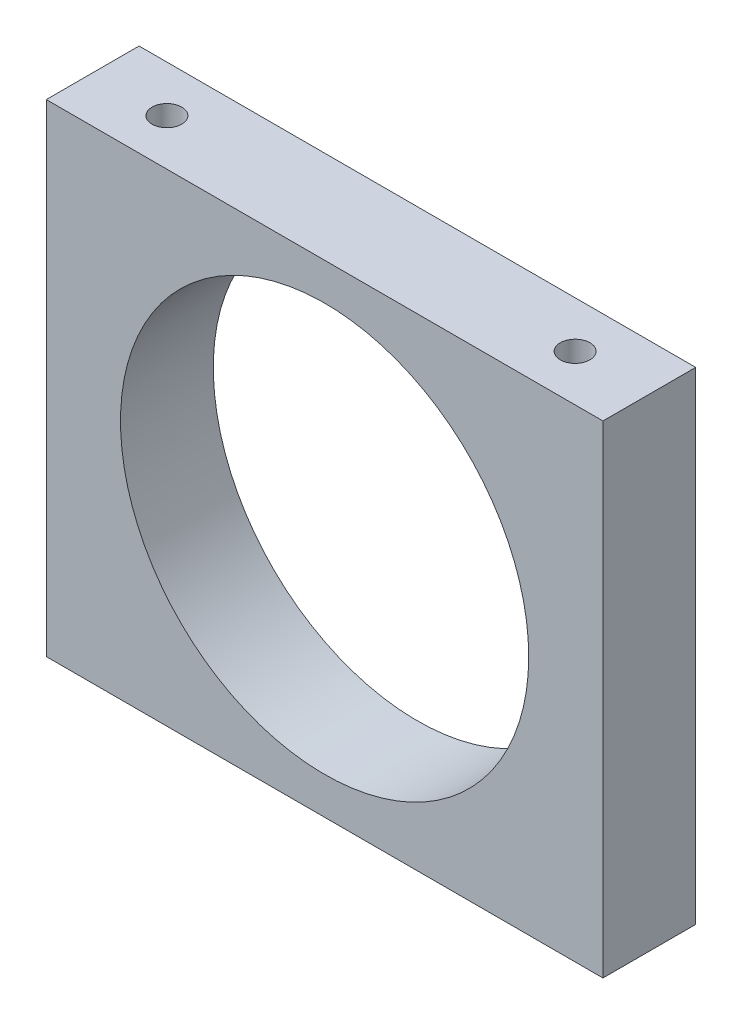
ISO-10303-21;
HEADER;
FILE_DESCRIPTION(('STEP AP214'),'2;1');
FILE_NAME('part.step','',(''),(''),'','','');
FILE_SCHEMA(('AUTOMOTIVE_DESIGN { 1 0 10303 214 1 1 1 1 }'));
ENDSEC;
DATA;
#1=APPLICATION_CONTEXT('core data for automotive mechanical design processes');
#2=APPLICATION_PROTOCOL_DEFINITION('international standard','automotive_design',2000,#1);
#3=PRODUCT_CONTEXT('',#1,'mechanical');
#4=PRODUCT('Part','Part','',(#3));
#5=PRODUCT_RELATED_PRODUCT_CATEGORY('part','',(#4));
#6=PRODUCT_DEFINITION_FORMATION('','',#4);
#7=PRODUCT_DEFINITION_CONTEXT('part definition',#1,'design');
#8=PRODUCT_DEFINITION('design','',#6,#7);
#9=PRODUCT_DEFINITION_SHAPE('','',#8);
#10=(LENGTH_UNIT() NAMED_UNIT(*) SI_UNIT(.MILLI.,.METRE.));
#11=(NAMED_UNIT(*) PLANE_ANGLE_UNIT() SI_UNIT($,.RADIAN.));
#12=(NAMED_UNIT(*) SI_UNIT($,.STERADIAN.) SOLID_ANGLE_UNIT());
#13=UNCERTAINTY_MEASURE_WITH_UNIT(LENGTH_MEASURE(1.E-05),#10,'distance_accuracy_value','');
#14=(GEOMETRIC_REPRESENTATION_CONTEXT(3) GLOBAL_UNCERTAINTY_ASSIGNED_CONTEXT((#13)) GLOBAL_UNIT_ASSIGNED_CONTEXT((#10,
#11,#12)) REPRESENTATION_CONTEXT('',''));
#15=CARTESIAN_POINT('',(0.,0.,0.));
#16=DIRECTION('',(0.,0.,1.));
#17=DIRECTION('',(1.,0.,0.));
#18=AXIS2_PLACEMENT_3D('',#15,#16,#17);
#19=CARTESIAN_POINT('',(0.,0.,5.));
#20=DIRECTION('',(0.,0.,-1.));
#21=DIRECTION('',(-1.,0.,0.));
#22=AXIS2_PLACEMENT_3D('',#19,#20,#21);
#23=PLANE('',#22);
#24=DIRECTION('',(0.,-1.,0.));
#25=VECTOR('',#24,1.);
#26=CARTESIAN_POINT('',(0.,0.,5.));
#27=LINE('',#26,#25);
#28=CARTESIAN_POINT('',(0.,26.,5.));
#29=VERTEX_POINT('',#28);
#30=CARTESIAN_POINT('',(0.,0.,5.));
#31=VERTEX_POINT('',#30);
#32=EDGE_CURVE('E134',#29,#31,#27,.T.);
#33=ORIENTED_EDGE('',*,*,#32,.T.);
#34=DIRECTION('',(1.,0.,0.));
#35=VECTOR('',#34,1.);
#36=CARTESIAN_POINT('',(0.,0.,5.));
#37=LINE('',#36,#35);
#38=CARTESIAN_POINT('',(30.,0.,5.));
#39=VERTEX_POINT('',#38);
#40=EDGE_CURVE('E81',#31,#39,#37,.T.);
#41=ORIENTED_EDGE('',*,*,#40,.T.);
#42=DIRECTION('',(0.,1.,0.));
#43=VECTOR('',#42,1.);
#44=CARTESIAN_POINT('',(30.,0.,5.));
#45=LINE('',#44,#43);
#46=CARTESIAN_POINT('',(30.,26.,5.));
#47=VERTEX_POINT('',#46);
#48=EDGE_CURVE('E137',#39,#47,#45,.T.);
#49=ORIENTED_EDGE('',*,*,#48,.T.);
#50=DIRECTION('',(-1.,0.,0.));
#51=VECTOR('',#50,1.);
#52=CARTESIAN_POINT('',(0.,26.,5.));
#53=LINE('',#52,#51);
#54=EDGE_CURVE('E50',#47,#29,#53,.T.);
#55=ORIENTED_EDGE('',*,*,#54,.T.);
#56=EDGE_LOOP('',(#33,#41,#49,#55));
#57=FACE_BOUND('',#56,.T.);
#58=CARTESIAN_POINT('',(15.,13.,5.));
#59=DIRECTION('',(0.,0.,1.));
#60=DIRECTION('',(1.,0.,0.));
#61=AXIS2_PLACEMENT_3D('',#58,#59,#60);
#62=CIRCLE('',#61,11.);
#63=CARTESIAN_POINT('',(26.,13.,5.));
#64=VERTEX_POINT('',#63);
#65=EDGE_CURVE('E128',#64,#64,#62,.T.);
#66=ORIENTED_EDGE('',*,*,#65,.F.);
#67=EDGE_LOOP('',(#66));
#68=FACE_BOUND('',#67,.T.);
#69=ADVANCED_FACE('F33',(#57,#68),#23,.F.);
#70=CARTESIAN_POINT('',(0.,0.,0.));
#71=DIRECTION('',(0.,0.,-1.));
#72=DIRECTION('',(-1.,0.,0.));
#73=AXIS2_PLACEMENT_3D('',#70,#71,#72);
#74=PLANE('',#73);
#75=DIRECTION('',(0.,-1.,0.));
#76=VECTOR('',#75,1.);
#77=CARTESIAN_POINT('',(0.,0.,0.));
#78=LINE('',#77,#76);
#79=CARTESIAN_POINT('',(0.,26.,0.));
#80=VERTEX_POINT('',#79);
#81=CARTESIAN_POINT('',(0.,0.,0.));
#82=VERTEX_POINT('',#81);
#83=EDGE_CURVE('E131',#80,#82,#78,.T.);
#84=ORIENTED_EDGE('',*,*,#83,.F.);
#85=DIRECTION('',(-1.,0.,0.));
#86=VECTOR('',#85,1.);
#87=CARTESIAN_POINT('',(0.,26.,0.));
#88=LINE('',#87,#86);
#89=CARTESIAN_POINT('',(30.,26.,0.));
#90=VERTEX_POINT('',#89);
#91=EDGE_CURVE('E74',#90,#80,#88,.T.);
#92=ORIENTED_EDGE('',*,*,#91,.F.);
#93=DIRECTION('',(0.,1.,0.));
#94=VECTOR('',#93,1.);
#95=CARTESIAN_POINT('',(30.,0.,0.));
#96=LINE('',#95,#94);
#97=CARTESIAN_POINT('',(30.,0.,0.));
#98=VERTEX_POINT('',#97);
#99=EDGE_CURVE('E68',#98,#90,#96,.T.);
#100=ORIENTED_EDGE('',*,*,#99,.F.);
#101=DIRECTION('',(1.,0.,0.));
#102=VECTOR('',#101,1.);
#103=CARTESIAN_POINT('',(0.,0.,0.));
#104=LINE('',#103,#102);
#105=EDGE_CURVE('E143',#82,#98,#104,.T.);
#106=ORIENTED_EDGE('',*,*,#105,.F.);
#107=EDGE_LOOP('',(#84,#92,#100,#106));
#108=FACE_BOUND('',#107,.T.);
#109=CARTESIAN_POINT('',(15.,13.,0.));
#110=DIRECTION('',(0.,0.,1.));
#111=DIRECTION('',(1.,0.,0.));
#112=AXIS2_PLACEMENT_3D('',#109,#110,#111);
#113=CIRCLE('',#112,11.);
#114=CARTESIAN_POINT('',(26.,13.,0.));
#115=VERTEX_POINT('',#114);
#116=EDGE_CURVE('E127',#115,#115,#113,.T.);
#117=ORIENTED_EDGE('',*,*,#116,.T.);
#118=EDGE_LOOP('',(#117));
#119=FACE_BOUND('',#118,.T.);
#120=ADVANCED_FACE('F153',(#108,#119),#74,.T.);
#121=CARTESIAN_POINT('',(0.,0.,5.));
#122=DIRECTION('',(1.,0.,0.));
#123=DIRECTION('',(0.,0.,-1.));
#124=AXIS2_PLACEMENT_3D('',#121,#122,#123);
#125=PLANE('',#124);
#126=ORIENTED_EDGE('',*,*,#83,.T.);
#127=DIRECTION('',(0.,0.,-1.));
#128=VECTOR('',#127,1.);
#129=CARTESIAN_POINT('',(0.,0.,5.));
#130=LINE('',#129,#128);
#131=EDGE_CURVE('E11',#31,#82,#130,.T.);
#132=ORIENTED_EDGE('',*,*,#131,.F.);
#133=ORIENTED_EDGE('',*,*,#32,.F.);
#134=DIRECTION('',(0.,0.,-1.));
#135=VECTOR('',#134,1.);
#136=CARTESIAN_POINT('',(0.,26.,5.));
#137=LINE('',#136,#135);
#138=EDGE_CURVE('E140',#29,#80,#137,.T.);
#139=ORIENTED_EDGE('',*,*,#138,.T.);
#140=EDGE_LOOP('',(#126,#132,#133,#139));
#141=FACE_BOUND('',#140,.T.);
#142=ADVANCED_FACE('F35',(#141),#125,.F.);
#143=CARTESIAN_POINT('',(0.,0.,5.));
#144=DIRECTION('',(0.,1.,0.));
#145=DIRECTION('',(0.,0.,1.));
#146=AXIS2_PLACEMENT_3D('',#143,#144,#145);
#147=PLANE('',#146);
#148=CARTESIAN_POINT('',(4.,0.,2.5));
#149=DIRECTION('',(0.,-1.,0.));
#150=DIRECTION('',(0.,0.,-1.));
#151=AXIS2_PLACEMENT_3D('',#148,#149,#150);
#152=CIRCLE('',#151,0.79999999999999);
#153=CARTESIAN_POINT('',(4.,0.,1.70000000000001));
#154=VERTEX_POINT('',#153);
#155=EDGE_CURVE('E105',#154,#154,#152,.T.);
#156=ORIENTED_EDGE('',*,*,#155,.F.);
#157=EDGE_LOOP('',(#156));
#158=FACE_BOUND('',#157,.T.);
#159=CARTESIAN_POINT('',(26.,0.,2.5));
#160=DIRECTION('',(0.,-1.,0.));
#161=DIRECTION('',(0.,0.,-1.));
#162=AXIS2_PLACEMENT_3D('',#159,#160,#161);
#163=CIRCLE('',#162,0.799999999999992);
#164=CARTESIAN_POINT('',(26.,0.,1.70000000000001));
#165=VERTEX_POINT('',#164);
#166=EDGE_CURVE('E104',#165,#165,#163,.T.);
#167=ORIENTED_EDGE('',*,*,#166,.F.);
#168=EDGE_LOOP('',(#167));
#169=FACE_BOUND('',#168,.T.);
#170=ORIENTED_EDGE('',*,*,#105,.T.);
#171=DIRECTION('',(0.,0.,-1.));
#172=VECTOR('',#171,1.);
#173=CARTESIAN_POINT('',(30.,0.,5.));
#174=LINE('',#173,#172);
#175=EDGE_CURVE('E42',#39,#98,#174,.T.);
#176=ORIENTED_EDGE('',*,*,#175,.F.);
#177=ORIENTED_EDGE('',*,*,#40,.F.);
#178=ORIENTED_EDGE('',*,*,#131,.T.);
#179=EDGE_LOOP('',(#170,#176,#177,#178));
#180=FACE_BOUND('',#179,.T.);
#181=ADVANCED_FACE('F170',(#158,#169,#180),#147,.F.);
#182=CARTESIAN_POINT('',(30.,0.,5.));
#183=DIRECTION('',(-1.,0.,0.));
#184=DIRECTION('',(0.,0.,1.));
#185=AXIS2_PLACEMENT_3D('',#182,#183,#184);
#186=PLANE('',#185);
#187=ORIENTED_EDGE('',*,*,#99,.T.);
#188=DIRECTION('',(0.,0.,-1.));
#189=VECTOR('',#188,1.);
#190=CARTESIAN_POINT('',(30.,26.,5.));
#191=LINE('',#190,#189);
#192=EDGE_CURVE('E148',#47,#90,#191,.T.);
#193=ORIENTED_EDGE('',*,*,#192,.F.);
#194=ORIENTED_EDGE('',*,*,#48,.F.);
#195=ORIENTED_EDGE('',*,*,#175,.T.);
#196=EDGE_LOOP('',(#187,#193,#194,#195));
#197=FACE_BOUND('',#196,.T.);
#198=ADVANCED_FACE('F150',(#197),#186,.F.);
#199=CARTESIAN_POINT('',(0.,26.,5.));
#200=DIRECTION('',(0.,-1.,0.));
#201=DIRECTION('',(0.,0.,-1.));
#202=AXIS2_PLACEMENT_3D('',#199,#200,#201);
#203=PLANE('',#202);
#204=CARTESIAN_POINT('',(4.,26.,2.5));
#205=DIRECTION('',(0.,1.,0.));
#206=DIRECTION('',(0.,0.,1.));
#207=AXIS2_PLACEMENT_3D('',#204,#205,#206);
#208=CIRCLE('',#207,0.79999999999999);
#209=CARTESIAN_POINT('',(4.,26.,3.29999999999999));
#210=VERTEX_POINT('',#209);
#211=EDGE_CURVE('E115',#210,#210,#208,.T.);
#212=ORIENTED_EDGE('',*,*,#211,.F.);
#213=EDGE_LOOP('',(#212));
#214=FACE_BOUND('',#213,.T.);
#215=CARTESIAN_POINT('',(26.,26.,2.5));
#216=DIRECTION('',(0.,1.,0.));
#217=DIRECTION('',(0.,0.,1.));
#218=AXIS2_PLACEMENT_3D('',#215,#216,#217);
#219=CIRCLE('',#218,0.799999999999992);
#220=CARTESIAN_POINT('',(26.,26.,3.29999999999999));
#221=VERTEX_POINT('',#220);
#222=EDGE_CURVE('E121',#221,#221,#219,.T.);
#223=ORIENTED_EDGE('',*,*,#222,.F.);
#224=EDGE_LOOP('',(#223));
#225=FACE_BOUND('',#224,.T.);
#226=ORIENTED_EDGE('',*,*,#91,.T.);
#227=ORIENTED_EDGE('',*,*,#138,.F.);
#228=ORIENTED_EDGE('',*,*,#54,.F.);
#229=ORIENTED_EDGE('',*,*,#192,.T.);
#230=EDGE_LOOP('',(#226,#227,#228,#229));
#231=FACE_BOUND('',#230,.T.);
#232=ADVANCED_FACE('F158',(#214,#225,#231),#203,.F.);
#233=CARTESIAN_POINT('',(15.,13.,5.));
#234=DIRECTION('',(0.,0.,-1.));
#235=DIRECTION('',(-1.,0.,0.));
#236=AXIS2_PLACEMENT_3D('',#233,#234,#235);
#237=CYLINDRICAL_SURFACE('',#236,11.);
#238=ORIENTED_EDGE('',*,*,#65,.T.);
#239=EDGE_LOOP('',(#238));
#240=FACE_BOUND('',#239,.T.);
#241=ORIENTED_EDGE('',*,*,#116,.F.);
#242=EDGE_LOOP('',(#241));
#243=FACE_BOUND('',#242,.T.);
#244=ADVANCED_FACE('F160',(#240,#243),#237,.F.);
#245=CARTESIAN_POINT('',(26.,21.,2.5));
#246=DIRECTION('',(0.,1.,0.));
#247=DIRECTION('',(0.,0.,1.));
#248=AXIS2_PLACEMENT_3D('',#245,#246,#247);
#249=CONICAL_SURFACE('',#248,0.799999999999988,1.02974425867665);
#250=CARTESIAN_POINT('',(26.,20.519311504778,2.5));
#251=VERTEX_POINT('',#250);
#252=VERTEX_LOOP('',#251);
#253=FACE_BOUND('',#252,.T.);
#254=CARTESIAN_POINT('',(26.,21.,2.5));
#255=DIRECTION('',(0.,1.,0.));
#256=DIRECTION('',(0.,0.,1.));
#257=AXIS2_PLACEMENT_3D('',#254,#255,#256);
#258=CIRCLE('',#257,0.799999999999988);
#259=CARTESIAN_POINT('',(26.,21.,3.29999999999999));
#260=VERTEX_POINT('',#259);
#261=EDGE_CURVE('E124',#260,#260,#258,.T.);
#262=ORIENTED_EDGE('',*,*,#261,.T.);
#263=EDGE_LOOP('',(#262));
#264=FACE_BOUND('',#263,.T.);
#265=ADVANCED_FACE('F167',(#253,#264),#249,.F.);
#266=CARTESIAN_POINT('',(26.,26.,2.5));
#267=DIRECTION('',(0.,1.,0.));
#268=DIRECTION('',(0.,0.,1.));
#269=AXIS2_PLACEMENT_3D('',#266,#267,#268);
#270=CYLINDRICAL_SURFACE('',#269,0.79999999999999);
#271=ORIENTED_EDGE('',*,*,#261,.F.);
#272=EDGE_LOOP('',(#271));
#273=FACE_BOUND('',#272,.T.);
#274=ORIENTED_EDGE('',*,*,#222,.T.);
#275=EDGE_LOOP('',(#274));
#276=FACE_BOUND('',#275,.T.);
#277=ADVANCED_FACE('F184',(#273,#276),#270,.F.);
#278=CARTESIAN_POINT('',(4.,21.,2.5));
#279=DIRECTION('',(0.,1.,0.));
#280=DIRECTION('',(0.,0.,1.));
#281=AXIS2_PLACEMENT_3D('',#278,#279,#280);
#282=CONICAL_SURFACE('',#281,0.799999999999988,1.02974425867665);
#283=CARTESIAN_POINT('',(4.,20.519311504778,2.5));
#284=VERTEX_POINT('',#283);
#285=VERTEX_LOOP('',#284);
#286=FACE_BOUND('',#285,.T.);
#287=CARTESIAN_POINT('',(4.,21.,2.5));
#288=DIRECTION('',(0.,1.,0.));
#289=DIRECTION('',(0.,0.,1.));
#290=AXIS2_PLACEMENT_3D('',#287,#288,#289);
#291=CIRCLE('',#290,0.799999999999988);
#292=CARTESIAN_POINT('',(4.,21.,3.29999999999999));
#293=VERTEX_POINT('',#292);
#294=EDGE_CURVE('E118',#293,#293,#291,.T.);
#295=ORIENTED_EDGE('',*,*,#294,.T.);
#296=EDGE_LOOP('',(#295));
#297=FACE_BOUND('',#296,.T.);
#298=ADVANCED_FACE('F188',(#286,#297),#282,.F.);
#299=CARTESIAN_POINT('',(4.,26.,2.5));
#300=DIRECTION('',(0.,1.,0.));
#301=DIRECTION('',(0.,0.,1.));
#302=AXIS2_PLACEMENT_3D('',#299,#300,#301);
#303=CYLINDRICAL_SURFACE('',#302,0.799999999999989);
#304=ORIENTED_EDGE('',*,*,#294,.F.);
#305=EDGE_LOOP('',(#304));
#306=FACE_BOUND('',#305,.T.);
#307=ORIENTED_EDGE('',*,*,#211,.T.);
#308=EDGE_LOOP('',(#307));
#309=FACE_BOUND('',#308,.T.);
#310=ADVANCED_FACE('F192',(#306,#309),#303,.F.);
#311=CARTESIAN_POINT('',(26.,5.,2.5));
#312=DIRECTION('',(0.,-1.,0.));
#313=DIRECTION('',(0.,0.,-1.));
#314=AXIS2_PLACEMENT_3D('',#311,#312,#313);
#315=CONICAL_SURFACE('',#314,0.799999999999988,1.02974425867665);
#316=CARTESIAN_POINT('',(26.,5.48068849522205,2.5));
#317=VERTEX_POINT('',#316);
#318=VERTEX_LOOP('',#317);
#319=FACE_BOUND('',#318,.T.);
#320=CARTESIAN_POINT('',(26.,5.,2.5));
#321=DIRECTION('',(0.,-1.,0.));
#322=DIRECTION('',(0.,0.,-1.));
#323=AXIS2_PLACEMENT_3D('',#320,#321,#322);
#324=CIRCLE('',#323,0.799999999999988);
#325=CARTESIAN_POINT('',(26.,5.,1.70000000000001));
#326=VERTEX_POINT('',#325);
#327=EDGE_CURVE('E108',#326,#326,#324,.T.);
#328=ORIENTED_EDGE('',*,*,#327,.T.);
#329=EDGE_LOOP('',(#328));
#330=FACE_BOUND('',#329,.T.);
#331=ADVANCED_FACE('F196',(#319,#330),#315,.F.);
#332=CARTESIAN_POINT('',(26.,0.,2.5));
#333=DIRECTION('',(0.,-1.,0.));
#334=DIRECTION('',(0.,0.,-1.));
#335=AXIS2_PLACEMENT_3D('',#332,#333,#334);
#336=CYLINDRICAL_SURFACE('',#335,0.79999999999999);
#337=ORIENTED_EDGE('',*,*,#327,.F.);
#338=EDGE_LOOP('',(#337));
#339=FACE_BOUND('',#338,.T.);
#340=ORIENTED_EDGE('',*,*,#166,.T.);
#341=EDGE_LOOP('',(#340));
#342=FACE_BOUND('',#341,.T.);
#343=ADVANCED_FACE('F98',(#339,#342),#336,.F.);
#344=CARTESIAN_POINT('',(4.,5.,2.5));
#345=DIRECTION('',(0.,-1.,0.));
#346=DIRECTION('',(0.,0.,-1.));
#347=AXIS2_PLACEMENT_3D('',#344,#345,#346);
#348=CONICAL_SURFACE('',#347,0.799999999999988,1.02974425867665);
#349=CARTESIAN_POINT('',(4.,5.48068849522205,2.5));
#350=VERTEX_POINT('',#349);
#351=VERTEX_LOOP('',#350);
#352=FACE_BOUND('',#351,.T.);
#353=CARTESIAN_POINT('',(4.,5.,2.5));
#354=DIRECTION('',(0.,-1.,0.));
#355=DIRECTION('',(0.,0.,-1.));
#356=AXIS2_PLACEMENT_3D('',#353,#354,#355);
#357=CIRCLE('',#356,0.799999999999988);
#358=CARTESIAN_POINT('',(4.,5.,1.70000000000001));
#359=VERTEX_POINT('',#358);
#360=EDGE_CURVE('E102',#359,#359,#357,.T.);
#361=ORIENTED_EDGE('',*,*,#360,.T.);
#362=EDGE_LOOP('',(#361));
#363=FACE_BOUND('',#362,.T.);
#364=ADVANCED_FACE('F94',(#352,#363),#348,.F.);
#365=CARTESIAN_POINT('',(4.,0.,2.5));
#366=DIRECTION('',(0.,-1.,0.));
#367=DIRECTION('',(0.,0.,-1.));
#368=AXIS2_PLACEMENT_3D('',#365,#366,#367);
#369=CYLINDRICAL_SURFACE('',#368,0.799999999999989);
#370=ORIENTED_EDGE('',*,*,#360,.F.);
#371=EDGE_LOOP('',(#370));
#372=FACE_BOUND('',#371,.T.);
#373=ORIENTED_EDGE('',*,*,#155,.T.);
#374=EDGE_LOOP('',(#373));
#375=FACE_BOUND('',#374,.T.);
#376=ADVANCED_FACE('F97',(#372,#375),#369,.F.);
#377=CLOSED_SHELL('',(#69,#120,#142,#181,#198,#232,#244,#265,#277,#298,#310,#331,#343,#364,#376));
#378=MANIFOLD_SOLID_BREP('B2',#377);
#379=ADVANCED_BREP_SHAPE_REPRESENTATION('',(#18,#378),#14);
#380=SHAPE_DEFINITION_REPRESENTATION(#9,#379);
ENDSEC;
END-ISO-10303-21;
